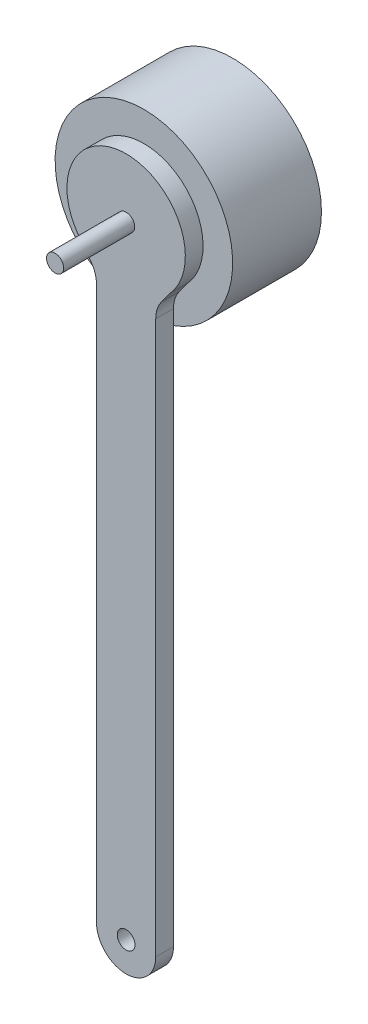
ISO-10303-21;
HEADER;
FILE_DESCRIPTION(('STEP AP214'),'2;1');
FILE_NAME('part.step','',(''),(''),'','','');
FILE_SCHEMA(('AUTOMOTIVE_DESIGN { 1 0 10303 214 1 1 1 1 }'));
ENDSEC;
DATA;
#1=APPLICATION_CONTEXT('core data for automotive mechanical design processes');
#2=APPLICATION_PROTOCOL_DEFINITION('international standard','automotive_design',2000,#1);
#3=PRODUCT_CONTEXT('',#1,'mechanical');
#4=PRODUCT('Part','Part','',(#3));
#5=PRODUCT_RELATED_PRODUCT_CATEGORY('part','',(#4));
#6=PRODUCT_DEFINITION_FORMATION('','',#4);
#7=PRODUCT_DEFINITION_CONTEXT('part definition',#1,'design');
#8=PRODUCT_DEFINITION('design','',#6,#7);
#9=PRODUCT_DEFINITION_SHAPE('','',#8);
#10=(LENGTH_UNIT() NAMED_UNIT(*) SI_UNIT(.MILLI.,.METRE.));
#11=(NAMED_UNIT(*) PLANE_ANGLE_UNIT() SI_UNIT($,.RADIAN.));
#12=(NAMED_UNIT(*) SI_UNIT($,.STERADIAN.) SOLID_ANGLE_UNIT());
#13=UNCERTAINTY_MEASURE_WITH_UNIT(LENGTH_MEASURE(1.E-05),#10,'distance_accuracy_value','');
#14=(GEOMETRIC_REPRESENTATION_CONTEXT(3) GLOBAL_UNCERTAINTY_ASSIGNED_CONTEXT((#13)) GLOBAL_UNIT_ASSIGNED_CONTEXT((#10,
#11,#12)) REPRESENTATION_CONTEXT('',''));
#15=CARTESIAN_POINT('',(0.,0.,0.));
#16=DIRECTION('',(0.,0.,1.));
#17=DIRECTION('',(1.,0.,0.));
#18=AXIS2_PLACEMENT_3D('',#15,#16,#17);
#19=CARTESIAN_POINT('',(0.,0.,15.));
#20=DIRECTION('',(0.,0.,1.));
#21=DIRECTION('',(1.,0.,0.));
#22=AXIS2_PLACEMENT_3D('',#19,#20,#21);
#23=PLANE('',#22);
#24=DIRECTION('',(0.593110939668227,0.805120744513438,0.));
#25=VECTOR('',#24,1.);
#26=CARTESIAN_POINT('',(5.,-9.99999999999999,15.));
#27=LINE('',#26,#25);
#28=CARTESIAN_POINT('',(5.97439627743281,-8.67730199551425,15.));
#29=VERTEX_POINT('',#28);
#30=CARTESIAN_POINT('',(7.46509360534931,-6.65374912837664,15.));
#31=VERTEX_POINT('',#30);
#32=EDGE_CURVE('E130',#29,#31,#27,.T.);
#33=ORIENTED_EDGE('',*,*,#32,.F.);
#34=CARTESIAN_POINT('',(10.,-11.6428566938554,15.));
#35=DIRECTION('',(0.,0.,1.));
#36=DIRECTION('',(1.,0.,0.));
#37=AXIS2_PLACEMENT_3D('',#34,#35,#36);
#38=CIRCLE('',#37,5.);
#39=CARTESIAN_POINT('',(5.,-11.6428566938554,15.));
#40=VERTEX_POINT('',#39);
#41=EDGE_CURVE('E179',#29,#40,#38,.T.);
#42=ORIENTED_EDGE('',*,*,#41,.T.);
#43=DIRECTION('',(0.,1.,0.));
#44=VECTOR('',#43,1.);
#45=CARTESIAN_POINT('',(5.,-9.99999999999999,15.));
#46=LINE('',#45,#44);
#47=CARTESIAN_POINT('',(5.,-14.1421356237309,15.));
#48=VERTEX_POINT('',#47);
#49=EDGE_CURVE('E148',#48,#40,#46,.T.);
#50=ORIENTED_EDGE('',*,*,#49,.F.);
#51=CARTESIAN_POINT('',(0.,0.,15.));
#52=DIRECTION('',(0.,0.,1.));
#53=DIRECTION('',(1.,0.,0.));
#54=AXIS2_PLACEMENT_3D('',#51,#52,#53);
#55=CIRCLE('',#54,15.);
#56=CARTESIAN_POINT('',(-5.,-14.1421356237309,15.));
#57=VERTEX_POINT('',#56);
#58=EDGE_CURVE('E167',#48,#57,#55,.T.);
#59=ORIENTED_EDGE('',*,*,#58,.T.);
#60=DIRECTION('',(0.,-1.,0.));
#61=VECTOR('',#60,1.);
#62=CARTESIAN_POINT('',(-5.,-9.99999999999999,15.));
#63=LINE('',#62,#61);
#64=CARTESIAN_POINT('',(-5.,-11.6428566938554,15.));
#65=VERTEX_POINT('',#64);
#66=EDGE_CURVE('E156',#65,#57,#63,.T.);
#67=ORIENTED_EDGE('',*,*,#66,.F.);
#68=CARTESIAN_POINT('',(-10.,-11.6428566938554,15.));
#69=DIRECTION('',(0.,0.,1.));
#70=DIRECTION('',(1.,0.,0.));
#71=AXIS2_PLACEMENT_3D('',#68,#69,#70);
#72=CIRCLE('',#71,5.);
#73=CARTESIAN_POINT('',(-5.97439627743281,-8.67730199551426,15.));
#74=VERTEX_POINT('',#73);
#75=EDGE_CURVE('E177',#65,#74,#72,.T.);
#76=ORIENTED_EDGE('',*,*,#75,.T.);
#77=DIRECTION('',(0.593110939668227,-0.805120744513438,0.));
#78=VECTOR('',#77,1.);
#79=CARTESIAN_POINT('',(-5.,-9.99999999999999,15.));
#80=LINE('',#79,#78);
#81=CARTESIAN_POINT('',(-7.46509360534931,-6.65374912837663,15.));
#82=VERTEX_POINT('',#81);
#83=EDGE_CURVE('E152',#82,#74,#80,.T.);
#84=ORIENTED_EDGE('',*,*,#83,.F.);
#85=CARTESIAN_POINT('',(0.,0.,15.));
#86=DIRECTION('',(0.,0.,1.));
#87=DIRECTION('',(1.,0.,0.));
#88=AXIS2_PLACEMENT_3D('',#85,#86,#87);
#89=CIRCLE('',#88,10.);
#90=EDGE_CURVE('E150',#31,#82,#89,.T.);
#91=ORIENTED_EDGE('',*,*,#90,.F.);
#92=EDGE_LOOP('',(#33,#42,#50,#59,#67,#76,#84,#91));
#93=FACE_BOUND('',#92,.T.);
#94=ADVANCED_FACE('F36',(#93),#23,.T.);
#95=CARTESIAN_POINT('',(0.,0.,15.));
#96=DIRECTION('',(0.,0.,-1.));
#97=DIRECTION('',(-1.,0.,0.));
#98=AXIS2_PLACEMENT_3D('',#95,#96,#97);
#99=CYLINDRICAL_SURFACE('',#98,15.);
#100=EDGE_CURVE('E163',#57,#48,#55,.T.);
#101=ORIENTED_EDGE('',*,*,#100,.F.);
#102=ORIENTED_EDGE('',*,*,#58,.F.);
#103=EDGE_LOOP('',(#101,#102));
#104=FACE_BOUND('',#103,.T.);
#105=CARTESIAN_POINT('',(0.,0.,0.));
#106=DIRECTION('',(0.,0.,1.));
#107=DIRECTION('',(1.,0.,0.));
#108=AXIS2_PLACEMENT_3D('',#105,#106,#107);
#109=CIRCLE('',#108,15.);
#110=CARTESIAN_POINT('',(15.,0.,0.));
#111=VERTEX_POINT('',#110);
#112=EDGE_CURVE('E162',#111,#111,#109,.T.);
#113=ORIENTED_EDGE('',*,*,#112,.T.);
#114=EDGE_LOOP('',(#113));
#115=FACE_BOUND('',#114,.T.);
#116=ADVANCED_FACE('F226',(#104,#115),#99,.T.);
#117=CARTESIAN_POINT('',(0.,0.,0.));
#118=DIRECTION('',(0.,0.,1.));
#119=DIRECTION('',(1.,0.,0.));
#120=AXIS2_PLACEMENT_3D('',#117,#118,#119);
#121=PLANE('',#120);
#122=ORIENTED_EDGE('',*,*,#112,.F.);
#123=EDGE_LOOP('',(#122));
#124=FACE_BOUND('',#123,.T.);
#125=ADVANCED_FACE('F249',(#124),#121,.F.);
#126=CARTESIAN_POINT('',(5.,-9.99999999999999,18.));
#127=DIRECTION('',(-1.,0.,0.));
#128=DIRECTION('',(0.,-1.,0.));
#129=AXIS2_PLACEMENT_3D('',#126,#127,#128);
#130=PLANE('',#129);
#131=ORIENTED_EDGE('',*,*,#49,.T.);
#132=DIRECTION('',(0.,0.,-1.));
#133=VECTOR('',#132,1.);
#134=CARTESIAN_POINT('',(5.,-11.6428566938554,18.));
#135=LINE('',#134,#133);
#136=CARTESIAN_POINT('',(5.,-11.6428566938554,18.));
#137=VERTEX_POINT('',#136);
#138=EDGE_CURVE('E183',#40,#137,#135,.F.);
#139=ORIENTED_EDGE('',*,*,#138,.T.);
#140=DIRECTION('',(0.,1.,0.));
#141=VECTOR('',#140,1.);
#142=CARTESIAN_POINT('',(5.,-9.99999999999999,18.));
#143=LINE('',#142,#141);
#144=CARTESIAN_POINT('',(5.00000000000001,-105.,18.));
#145=VERTEX_POINT('',#144);
#146=EDGE_CURVE('E124',#145,#137,#143,.T.);
#147=ORIENTED_EDGE('',*,*,#146,.F.);
#148=DIRECTION('',(0.,0.,-1.));
#149=VECTOR('',#148,1.);
#150=CARTESIAN_POINT('',(5.00000000000001,-105.,18.));
#151=LINE('',#150,#149);
#152=CARTESIAN_POINT('',(5.00000000000001,-105.,15.));
#153=VERTEX_POINT('',#152);
#154=EDGE_CURVE('E181',#145,#153,#151,.T.);
#155=ORIENTED_EDGE('',*,*,#154,.T.);
#156=EDGE_CURVE('E146',#153,#48,#46,.T.);
#157=ORIENTED_EDGE('',*,*,#156,.T.);
#158=EDGE_LOOP('',(#131,#139,#147,#155,#157));
#159=FACE_BOUND('',#158,.T.);
#160=ADVANCED_FACE('F205',(#159),#130,.F.);
#161=CARTESIAN_POINT('',(5.,-9.99999999999999,18.));
#162=DIRECTION('',(-0.805120744513438,0.593110939668227,0.));
#163=DIRECTION('',(-0.593110939668227,-0.805120744513439,0.));
#164=AXIS2_PLACEMENT_3D('',#161,#162,#163);
#165=PLANE('',#164);
#166=DIRECTION('',(0.593110939668227,0.805120744513438,0.));
#167=VECTOR('',#166,1.);
#168=CARTESIAN_POINT('',(5.,-9.99999999999999,18.));
#169=LINE('',#168,#167);
#170=CARTESIAN_POINT('',(5.97439627743281,-8.67730199551425,18.));
#171=VERTEX_POINT('',#170);
#172=CARTESIAN_POINT('',(7.46509360534931,-6.65374912837664,18.));
#173=VERTEX_POINT('',#172);
#174=EDGE_CURVE('E112',#171,#173,#169,.T.);
#175=ORIENTED_EDGE('',*,*,#174,.F.);
#176=DIRECTION('',(0.,0.,-1.));
#177=VECTOR('',#176,1.);
#178=CARTESIAN_POINT('',(5.97439627743281,-8.67730199551425,15.));
#179=LINE('',#178,#177);
#180=EDGE_CURVE('E166',#171,#29,#179,.T.);
#181=ORIENTED_EDGE('',*,*,#180,.T.);
#182=ORIENTED_EDGE('',*,*,#32,.T.);
#183=DIRECTION('',(0.,0.,-1.));
#184=VECTOR('',#183,1.);
#185=CARTESIAN_POINT('',(7.46509360534931,-6.65374912837664,18.));
#186=LINE('',#185,#184);
#187=EDGE_CURVE('E127',#173,#31,#186,.T.);
#188=ORIENTED_EDGE('',*,*,#187,.F.);
#189=EDGE_LOOP('',(#175,#181,#182,#188));
#190=FACE_BOUND('',#189,.T.);
#191=ADVANCED_FACE('F128',(#190),#165,.F.);
#192=CARTESIAN_POINT('',(0.,0.,18.));
#193=DIRECTION('',(0.,0.,-1.));
#194=DIRECTION('',(-1.,0.,0.));
#195=AXIS2_PLACEMENT_3D('',#192,#193,#194);
#196=CYLINDRICAL_SURFACE('',#195,10.);
#197=ORIENTED_EDGE('',*,*,#90,.T.);
#198=DIRECTION('',(0.,0.,-1.));
#199=VECTOR('',#198,1.);
#200=CARTESIAN_POINT('',(-7.46509360534931,-6.65374912837663,18.));
#201=LINE('',#200,#199);
#202=CARTESIAN_POINT('',(-7.46509360534931,-6.65374912837663,18.));
#203=VERTEX_POINT('',#202);
#204=EDGE_CURVE('E134',#203,#82,#201,.T.);
#205=ORIENTED_EDGE('',*,*,#204,.F.);
#206=CARTESIAN_POINT('',(0.,0.,18.));
#207=DIRECTION('',(0.,0.,1.));
#208=DIRECTION('',(1.,0.,0.));
#209=AXIS2_PLACEMENT_3D('',#206,#207,#208);
#210=CIRCLE('',#209,10.);
#211=EDGE_CURVE('E117',#173,#203,#210,.T.);
#212=ORIENTED_EDGE('',*,*,#211,.F.);
#213=ORIENTED_EDGE('',*,*,#187,.T.);
#214=EDGE_LOOP('',(#197,#205,#212,#213));
#215=FACE_BOUND('',#214,.T.);
#216=ADVANCED_FACE('F136',(#215),#196,.T.);
#217=CARTESIAN_POINT('',(-5.,-9.99999999999999,18.));
#218=DIRECTION('',(0.805120744513438,0.593110939668227,0.));
#219=DIRECTION('',(-0.593110939668227,0.805120744513438,0.));
#220=AXIS2_PLACEMENT_3D('',#217,#218,#219);
#221=PLANE('',#220);
#222=ORIENTED_EDGE('',*,*,#83,.T.);
#223=DIRECTION('',(0.,0.,-1.));
#224=VECTOR('',#223,1.);
#225=CARTESIAN_POINT('',(-5.97439627743281,-8.67730199551426,18.));
#226=LINE('',#225,#224);
#227=CARTESIAN_POINT('',(-5.97439627743281,-8.67730199551426,18.));
#228=VERTEX_POINT('',#227);
#229=EDGE_CURVE('E191',#74,#228,#226,.F.);
#230=ORIENTED_EDGE('',*,*,#229,.T.);
#231=DIRECTION('',(0.593110939668227,-0.805120744513438,0.));
#232=VECTOR('',#231,1.);
#233=CARTESIAN_POINT('',(-5.,-9.99999999999999,18.));
#234=LINE('',#233,#232);
#235=EDGE_CURVE('E139',#203,#228,#234,.T.);
#236=ORIENTED_EDGE('',*,*,#235,.F.);
#237=ORIENTED_EDGE('',*,*,#204,.T.);
#238=EDGE_LOOP('',(#222,#230,#236,#237));
#239=FACE_BOUND('',#238,.T.);
#240=ADVANCED_FACE('F231',(#239),#221,.F.);
#241=CARTESIAN_POINT('',(-5.,-9.99999999999999,18.));
#242=DIRECTION('',(1.,0.,0.));
#243=DIRECTION('',(0.,1.,0.));
#244=AXIS2_PLACEMENT_3D('',#241,#242,#243);
#245=PLANE('',#244);
#246=DIRECTION('',(0.,-1.,0.));
#247=VECTOR('',#246,1.);
#248=CARTESIAN_POINT('',(-5.,-9.99999999999999,18.));
#249=LINE('',#248,#247);
#250=CARTESIAN_POINT('',(-5.,-11.6428566938554,18.));
#251=VERTEX_POINT('',#250);
#252=CARTESIAN_POINT('',(-4.99999999999999,-105.,18.));
#253=VERTEX_POINT('',#252);
#254=EDGE_CURVE('E141',#251,#253,#249,.T.);
#255=ORIENTED_EDGE('',*,*,#254,.F.);
#256=DIRECTION('',(0.,0.,-1.));
#257=VECTOR('',#256,1.);
#258=CARTESIAN_POINT('',(-5.,-11.6428566938554,15.));
#259=LINE('',#258,#257);
#260=EDGE_CURVE('E188',#251,#65,#259,.T.);
#261=ORIENTED_EDGE('',*,*,#260,.T.);
#262=ORIENTED_EDGE('',*,*,#66,.T.);
#263=CARTESIAN_POINT('',(-4.99999999999999,-105.,15.));
#264=VERTEX_POINT('',#263);
#265=EDGE_CURVE('E155',#57,#264,#63,.T.);
#266=ORIENTED_EDGE('',*,*,#265,.T.);
#267=DIRECTION('',(0.,0.,-1.));
#268=VECTOR('',#267,1.);
#269=CARTESIAN_POINT('',(-4.99999999999999,-105.,18.));
#270=LINE('',#269,#268);
#271=EDGE_CURVE('E185',#264,#253,#270,.F.);
#272=ORIENTED_EDGE('',*,*,#271,.T.);
#273=EDGE_LOOP('',(#255,#261,#262,#266,#272));
#274=FACE_BOUND('',#273,.T.);
#275=ADVANCED_FACE('F217',(#274),#245,.F.);
#276=CARTESIAN_POINT('',(0.,0.,18.));
#277=DIRECTION('',(0.,0.,1.));
#278=DIRECTION('',(1.,0.,0.));
#279=AXIS2_PLACEMENT_3D('',#276,#277,#278);
#280=PLANE('',#279);
#281=CARTESIAN_POINT('',(0.,-105.,18.));
#282=DIRECTION('',(0.,0.,1.));
#283=DIRECTION('',(1.,0.,0.));
#284=AXIS2_PLACEMENT_3D('',#281,#282,#283);
#285=CIRCLE('',#284,1.5);
#286=CARTESIAN_POINT('',(1.5,-105.,18.));
#287=VERTEX_POINT('',#286);
#288=EDGE_CURVE('E175',#287,#287,#285,.T.);
#289=ORIENTED_EDGE('',*,*,#288,.F.);
#290=EDGE_LOOP('',(#289));
#291=FACE_BOUND('',#290,.T.);
#292=CARTESIAN_POINT('',(0.,0.,18.));
#293=DIRECTION('',(0.,0.,1.));
#294=DIRECTION('',(1.,0.,0.));
#295=AXIS2_PLACEMENT_3D('',#292,#293,#294);
#296=CIRCLE('',#295,1.45);
#297=CARTESIAN_POINT('',(1.45,0.,18.));
#298=VERTEX_POINT('',#297);
#299=EDGE_CURVE('E133',#298,#298,#296,.T.);
#300=ORIENTED_EDGE('',*,*,#299,.F.);
#301=EDGE_LOOP('',(#300));
#302=FACE_BOUND('',#301,.T.);
#303=ORIENTED_EDGE('',*,*,#254,.T.);
#304=CARTESIAN_POINT('',(0.,-105.,18.));
#305=DIRECTION('',(0.,0.,1.));
#306=DIRECTION('',(1.,0.,0.));
#307=AXIS2_PLACEMENT_3D('',#304,#305,#306);
#308=CIRCLE('',#307,5.);
#309=CARTESIAN_POINT('',(0.,-110.,18.));
#310=VERTEX_POINT('',#309);
#311=EDGE_CURVE('E52',#253,#310,#308,.T.);
#312=ORIENTED_EDGE('',*,*,#311,.T.);
#313=CARTESIAN_POINT('',(0.,-105.,18.));
#314=DIRECTION('',(0.,0.,1.));
#315=DIRECTION('',(1.,0.,0.));
#316=AXIS2_PLACEMENT_3D('',#313,#314,#315);
#317=CIRCLE('',#316,5.);
#318=EDGE_CURVE('E196',#310,#145,#317,.T.);
#319=ORIENTED_EDGE('',*,*,#318,.T.);
#320=ORIENTED_EDGE('',*,*,#146,.T.);
#321=CARTESIAN_POINT('',(10.,-11.6428566938554,18.));
#322=DIRECTION('',(0.,0.,1.));
#323=DIRECTION('',(1.,0.,0.));
#324=AXIS2_PLACEMENT_3D('',#321,#322,#323);
#325=CIRCLE('',#324,5.);
#326=EDGE_CURVE('E45',#137,#171,#325,.F.);
#327=ORIENTED_EDGE('',*,*,#326,.T.);
#328=ORIENTED_EDGE('',*,*,#174,.T.);
#329=ORIENTED_EDGE('',*,*,#211,.T.);
#330=ORIENTED_EDGE('',*,*,#235,.T.);
#331=CARTESIAN_POINT('',(-10.,-11.6428566938554,18.));
#332=DIRECTION('',(0.,0.,1.));
#333=DIRECTION('',(1.,0.,0.));
#334=AXIS2_PLACEMENT_3D('',#331,#332,#333);
#335=CIRCLE('',#334,5.);
#336=EDGE_CURVE('E11',#228,#251,#335,.F.);
#337=ORIENTED_EDGE('',*,*,#336,.T.);
#338=EDGE_LOOP('',(#303,#312,#319,#320,#327,#328,#329,#330,#337));
#339=FACE_BOUND('',#338,.T.);
#340=ADVANCED_FACE('F114',(#291,#302,#339),#280,.T.);
#341=CARTESIAN_POINT('',(0.,0.,15.));
#342=DIRECTION('',(0.,0.,1.));
#343=DIRECTION('',(1.,0.,0.));
#344=AXIS2_PLACEMENT_3D('',#341,#342,#343);
#345=PLANE('',#344);
#346=CARTESIAN_POINT('',(0.,-105.,15.));
#347=DIRECTION('',(0.,0.,1.));
#348=DIRECTION('',(1.,0.,0.));
#349=AXIS2_PLACEMENT_3D('',#346,#347,#348);
#350=CIRCLE('',#349,1.5);
#351=CARTESIAN_POINT('',(1.5,-105.,15.));
#352=VERTEX_POINT('',#351);
#353=EDGE_CURVE('E172',#352,#352,#350,.T.);
#354=ORIENTED_EDGE('',*,*,#353,.T.);
#355=EDGE_LOOP('',(#354));
#356=FACE_BOUND('',#355,.T.);
#357=CARTESIAN_POINT('',(0.,-105.,15.));
#358=DIRECTION('',(0.,0.,1.));
#359=DIRECTION('',(1.,0.,0.));
#360=AXIS2_PLACEMENT_3D('',#357,#358,#359);
#361=CIRCLE('',#360,5.);
#362=CARTESIAN_POINT('',(0.,-110.,15.));
#363=VERTEX_POINT('',#362);
#364=EDGE_CURVE('E60',#153,#363,#361,.F.);
#365=ORIENTED_EDGE('',*,*,#364,.T.);
#366=CARTESIAN_POINT('',(0.,-105.,15.));
#367=DIRECTION('',(0.,0.,1.));
#368=DIRECTION('',(1.,0.,0.));
#369=AXIS2_PLACEMENT_3D('',#366,#367,#368);
#370=CIRCLE('',#369,5.);
#371=EDGE_CURVE('E194',#363,#264,#370,.F.);
#372=ORIENTED_EDGE('',*,*,#371,.T.);
#373=ORIENTED_EDGE('',*,*,#265,.F.);
#374=ORIENTED_EDGE('',*,*,#100,.T.);
#375=ORIENTED_EDGE('',*,*,#156,.F.);
#376=EDGE_LOOP('',(#365,#372,#373,#374,#375));
#377=FACE_BOUND('',#376,.T.);
#378=ADVANCED_FACE('F213',(#356,#377),#345,.F.);
#379=CARTESIAN_POINT('',(0.,0.,30.));
#380=DIRECTION('',(0.,0.,1.));
#381=DIRECTION('',(1.,0.,0.));
#382=AXIS2_PLACEMENT_3D('',#379,#380,#381);
#383=PLANE('',#382);
#384=CARTESIAN_POINT('',(0.,0.,30.));
#385=DIRECTION('',(0.,0.,1.));
#386=DIRECTION('',(1.,0.,0.));
#387=AXIS2_PLACEMENT_3D('',#384,#385,#386);
#388=CIRCLE('',#387,1.45);
#389=CARTESIAN_POINT('',(1.45,0.,30.));
#390=VERTEX_POINT('',#389);
#391=EDGE_CURVE('E159',#390,#390,#388,.T.);
#392=ORIENTED_EDGE('',*,*,#391,.T.);
#393=EDGE_LOOP('',(#392));
#394=FACE_BOUND('',#393,.T.);
#395=ADVANCED_FACE('F267',(#394),#383,.T.);
#396=CARTESIAN_POINT('',(0.,0.,30.));
#397=DIRECTION('',(0.,0.,-1.));
#398=DIRECTION('',(-1.,0.,0.));
#399=AXIS2_PLACEMENT_3D('',#396,#397,#398);
#400=CYLINDRICAL_SURFACE('',#399,1.45);
#401=ORIENTED_EDGE('',*,*,#299,.T.);
#402=EDGE_LOOP('',(#401));
#403=FACE_BOUND('',#402,.T.);
#404=ORIENTED_EDGE('',*,*,#391,.F.);
#405=EDGE_LOOP('',(#404));
#406=FACE_BOUND('',#405,.T.);
#407=ADVANCED_FACE('F253',(#403,#406),#400,.T.);
#408=CARTESIAN_POINT('',(0.,-105.,0.));
#409=DIRECTION('',(0.,0.,1.));
#410=DIRECTION('',(1.,0.,0.));
#411=AXIS2_PLACEMENT_3D('',#408,#409,#410);
#412=CYLINDRICAL_SURFACE('',#411,1.5);
#413=ORIENTED_EDGE('',*,*,#288,.T.);
#414=EDGE_LOOP('',(#413));
#415=FACE_BOUND('',#414,.T.);
#416=ORIENTED_EDGE('',*,*,#353,.F.);
#417=EDGE_LOOP('',(#416));
#418=FACE_BOUND('',#417,.T.);
#419=ADVANCED_FACE('F242',(#415,#418),#412,.F.);
#420=CARTESIAN_POINT('',(10.,-11.6428566938554,18.));
#421=DIRECTION('',(0.,0.,1.));
#422=DIRECTION('',(1.,0.,0.));
#423=AXIS2_PLACEMENT_3D('',#420,#421,#422);
#424=CYLINDRICAL_SURFACE('',#423,5.);
#425=ORIENTED_EDGE('',*,*,#326,.F.);
#426=ORIENTED_EDGE('',*,*,#138,.F.);
#427=ORIENTED_EDGE('',*,*,#41,.F.);
#428=ORIENTED_EDGE('',*,*,#180,.F.);
#429=EDGE_LOOP('',(#425,#426,#427,#428));
#430=FACE_BOUND('',#429,.T.);
#431=ADVANCED_FACE('F229',(#430),#424,.F.);
#432=CARTESIAN_POINT('',(-10.,-11.6428566938554,18.));
#433=DIRECTION('',(0.,0.,1.));
#434=DIRECTION('',(1.,0.,0.));
#435=AXIS2_PLACEMENT_3D('',#432,#433,#434);
#436=CYLINDRICAL_SURFACE('',#435,5.);
#437=ORIENTED_EDGE('',*,*,#336,.F.);
#438=ORIENTED_EDGE('',*,*,#229,.F.);
#439=ORIENTED_EDGE('',*,*,#75,.F.);
#440=ORIENTED_EDGE('',*,*,#260,.F.);
#441=EDGE_LOOP('',(#437,#438,#439,#440));
#442=FACE_BOUND('',#441,.T.);
#443=ADVANCED_FACE('F235',(#442),#436,.F.);
#444=CARTESIAN_POINT('',(0.,-105.,18.));
#445=DIRECTION('',(0.,0.,-1.));
#446=DIRECTION('',(-1.,0.,0.));
#447=AXIS2_PLACEMENT_3D('',#444,#445,#446);
#448=CYLINDRICAL_SURFACE('',#447,5.);
#449=ORIENTED_EDGE('',*,*,#154,.F.);
#450=ORIENTED_EDGE('',*,*,#318,.F.);
#451=DIRECTION('',(0.,0.,-1.));
#452=VECTOR('',#451,1.);
#453=CARTESIAN_POINT('',(0.,-110.,18.));
#454=LINE('',#453,#452);
#455=EDGE_CURVE('E40',#363,#310,#454,.F.);
#456=ORIENTED_EDGE('',*,*,#455,.F.);
#457=ORIENTED_EDGE('',*,*,#364,.F.);
#458=EDGE_LOOP('',(#449,#450,#456,#457));
#459=FACE_BOUND('',#458,.T.);
#460=ADVANCED_FACE('F38',(#459),#448,.T.);
#461=CARTESIAN_POINT('',(0.,-105.,18.));
#462=DIRECTION('',(0.,0.,-1.));
#463=DIRECTION('',(-1.,0.,0.));
#464=AXIS2_PLACEMENT_3D('',#461,#462,#463);
#465=CYLINDRICAL_SURFACE('',#464,5.);
#466=ORIENTED_EDGE('',*,*,#311,.F.);
#467=ORIENTED_EDGE('',*,*,#271,.F.);
#468=ORIENTED_EDGE('',*,*,#371,.F.);
#469=ORIENTED_EDGE('',*,*,#455,.T.);
#470=EDGE_LOOP('',(#466,#467,#468,#469));
#471=FACE_BOUND('',#470,.T.);
#472=ADVANCED_FACE('F210',(#471),#465,.T.);
#473=CLOSED_SHELL('',(#94,#116,#125,#160,#191,#216,#240,#275,#340,#378,#395,#407,#419,#431,#443,
#460,#472));
#474=MANIFOLD_SOLID_BREP('B2',#473);
#475=ADVANCED_BREP_SHAPE_REPRESENTATION('',(#18,#474),#14);
#476=SHAPE_DEFINITION_REPRESENTATION(#9,#475);
ENDSEC;
END-ISO-10303-21;
